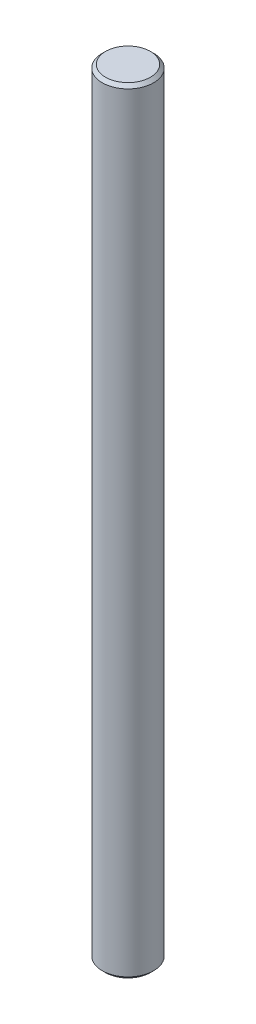
ISO-10303-21;
HEADER;
FILE_DESCRIPTION(('STEP AP214'),'2;1');
FILE_NAME('part.step','',(''),(''),'','','');
FILE_SCHEMA(('AUTOMOTIVE_DESIGN { 1 0 10303 214 1 1 1 1 }'));
ENDSEC;
DATA;
#1=APPLICATION_CONTEXT('core data for automotive mechanical design processes');
#2=APPLICATION_PROTOCOL_DEFINITION('international standard','automotive_design',2000,#1);
#3=PRODUCT_CONTEXT('',#1,'mechanical');
#4=PRODUCT('Part','Part','',(#3));
#5=PRODUCT_RELATED_PRODUCT_CATEGORY('part','',(#4));
#6=PRODUCT_DEFINITION_FORMATION('','',#4);
#7=PRODUCT_DEFINITION_CONTEXT('part definition',#1,'design');
#8=PRODUCT_DEFINITION('design','',#6,#7);
#9=PRODUCT_DEFINITION_SHAPE('','',#8);
#10=(LENGTH_UNIT() NAMED_UNIT(*) SI_UNIT(.MILLI.,.METRE.));
#11=(NAMED_UNIT(*) PLANE_ANGLE_UNIT() SI_UNIT($,.RADIAN.));
#12=(NAMED_UNIT(*) SI_UNIT($,.STERADIAN.) SOLID_ANGLE_UNIT());
#13=UNCERTAINTY_MEASURE_WITH_UNIT(LENGTH_MEASURE(1.E-05),#10,'distance_accuracy_value','');
#14=(GEOMETRIC_REPRESENTATION_CONTEXT(3) GLOBAL_UNCERTAINTY_ASSIGNED_CONTEXT((#13)) GLOBAL_UNIT_ASSIGNED_CONTEXT((#10,
#11,#12)) REPRESENTATION_CONTEXT('',''));
#15=CARTESIAN_POINT('',(0.,0.,0.));
#16=DIRECTION('',(0.,0.,1.));
#17=DIRECTION('',(1.,0.,0.));
#18=AXIS2_PLACEMENT_3D('',#15,#16,#17);
#19=CARTESIAN_POINT('',(0.,121.,0.));
#20=DIRECTION('',(0.,-1.,0.));
#21=DIRECTION('',(0.,0.,-1.));
#22=AXIS2_PLACEMENT_3D('',#19,#20,#21);
#23=CYLINDRICAL_SURFACE('',#22,4.);
#24=CARTESIAN_POINT('',(0.,0.5,0.));
#25=DIRECTION('',(0.,1.,0.));
#26=DIRECTION('',(0.,0.,1.));
#27=AXIS2_PLACEMENT_3D('',#24,#25,#26);
#28=CIRCLE('',#27,4.);
#29=CARTESIAN_POINT('',(0.,0.5,4.));
#30=VERTEX_POINT('',#29);
#31=EDGE_CURVE('E41',#30,#30,#28,.T.);
#32=ORIENTED_EDGE('',*,*,#31,.T.);
#33=EDGE_LOOP('',(#32));
#34=FACE_BOUND('',#33,.T.);
#35=CARTESIAN_POINT('',(0.,120.5,0.));
#36=DIRECTION('',(0.,1.,0.));
#37=DIRECTION('',(0.,0.,1.));
#38=AXIS2_PLACEMENT_3D('',#35,#36,#37);
#39=CIRCLE('',#38,4.);
#40=CARTESIAN_POINT('',(0.,120.5,4.));
#41=VERTEX_POINT('',#40);
#42=EDGE_CURVE('E45',#41,#41,#39,.F.);
#43=ORIENTED_EDGE('',*,*,#42,.T.);
#44=EDGE_LOOP('',(#43));
#45=FACE_BOUND('',#44,.T.);
#46=ADVANCED_FACE('F30',(#34,#45),#23,.T.);
#47=CARTESIAN_POINT('',(0.,121.,0.));
#48=DIRECTION('',(0.,1.,0.));
#49=DIRECTION('',(0.,0.,1.));
#50=AXIS2_PLACEMENT_3D('',#47,#48,#49);
#51=PLANE('',#50);
#52=CARTESIAN_POINT('',(0.,121.,0.));
#53=DIRECTION('',(0.,1.,0.));
#54=DIRECTION('',(0.,0.,1.));
#55=AXIS2_PLACEMENT_3D('',#52,#53,#54);
#56=CIRCLE('',#55,3.5);
#57=CARTESIAN_POINT('',(0.,121.,3.5));
#58=VERTEX_POINT('',#57);
#59=EDGE_CURVE('E10',#58,#58,#56,.T.);
#60=ORIENTED_EDGE('',*,*,#59,.T.);
#61=EDGE_LOOP('',(#60));
#62=FACE_BOUND('',#61,.T.);
#63=ADVANCED_FACE('F61',(#62),#51,.T.);
#64=CARTESIAN_POINT('',(0.,0.,0.));
#65=DIRECTION('',(0.,1.,0.));
#66=DIRECTION('',(0.,0.,1.));
#67=AXIS2_PLACEMENT_3D('',#64,#65,#66);
#68=PLANE('',#67);
#69=CARTESIAN_POINT('',(0.,0.,0.));
#70=DIRECTION('',(0.,1.,0.));
#71=DIRECTION('',(0.,0.,1.));
#72=AXIS2_PLACEMENT_3D('',#69,#70,#71);
#73=CIRCLE('',#72,3.5);
#74=CARTESIAN_POINT('',(0.,0.,3.5));
#75=VERTEX_POINT('',#74);
#76=EDGE_CURVE('E37',#75,#75,#73,.F.);
#77=ORIENTED_EDGE('',*,*,#76,.T.);
#78=EDGE_LOOP('',(#77));
#79=FACE_BOUND('',#78,.T.);
#80=ADVANCED_FACE('F58',(#79),#68,.F.);
#81=CARTESIAN_POINT('',(0.,0.5,0.));
#82=DIRECTION('',(0.,1.,0.));
#83=DIRECTION('',(0.,0.,1.));
#84=AXIS2_PLACEMENT_3D('',#81,#82,#83);
#85=CONICAL_SURFACE('',#84,4.,0.785398163397445);
#86=ORIENTED_EDGE('',*,*,#76,.F.);
#87=EDGE_LOOP('',(#86));
#88=FACE_BOUND('',#87,.T.);
#89=ORIENTED_EDGE('',*,*,#31,.F.);
#90=EDGE_LOOP('',(#89));
#91=FACE_BOUND('',#90,.T.);
#92=ADVANCED_FACE('F54',(#88,#91),#85,.T.);
#93=CARTESIAN_POINT('',(0.,121.,0.));
#94=DIRECTION('',(0.,-1.,0.));
#95=DIRECTION('',(0.,0.,-1.));
#96=AXIS2_PLACEMENT_3D('',#93,#94,#95);
#97=CONICAL_SURFACE('',#96,3.5,0.785398163397459);
#98=ORIENTED_EDGE('',*,*,#42,.F.);
#99=EDGE_LOOP('',(#98));
#100=FACE_BOUND('',#99,.T.);
#101=ORIENTED_EDGE('',*,*,#59,.F.);
#102=EDGE_LOOP('',(#101));
#103=FACE_BOUND('',#102,.T.);
#104=ADVANCED_FACE('F32',(#100,#103),#97,.T.);
#105=CLOSED_SHELL('',(#46,#63,#80,#92,#104));
#106=MANIFOLD_SOLID_BREP('B2',#105);
#107=ADVANCED_BREP_SHAPE_REPRESENTATION('',(#18,#106),#14);
#108=SHAPE_DEFINITION_REPRESENTATION(#9,#107);
ENDSEC;
END-ISO-10303-21;
